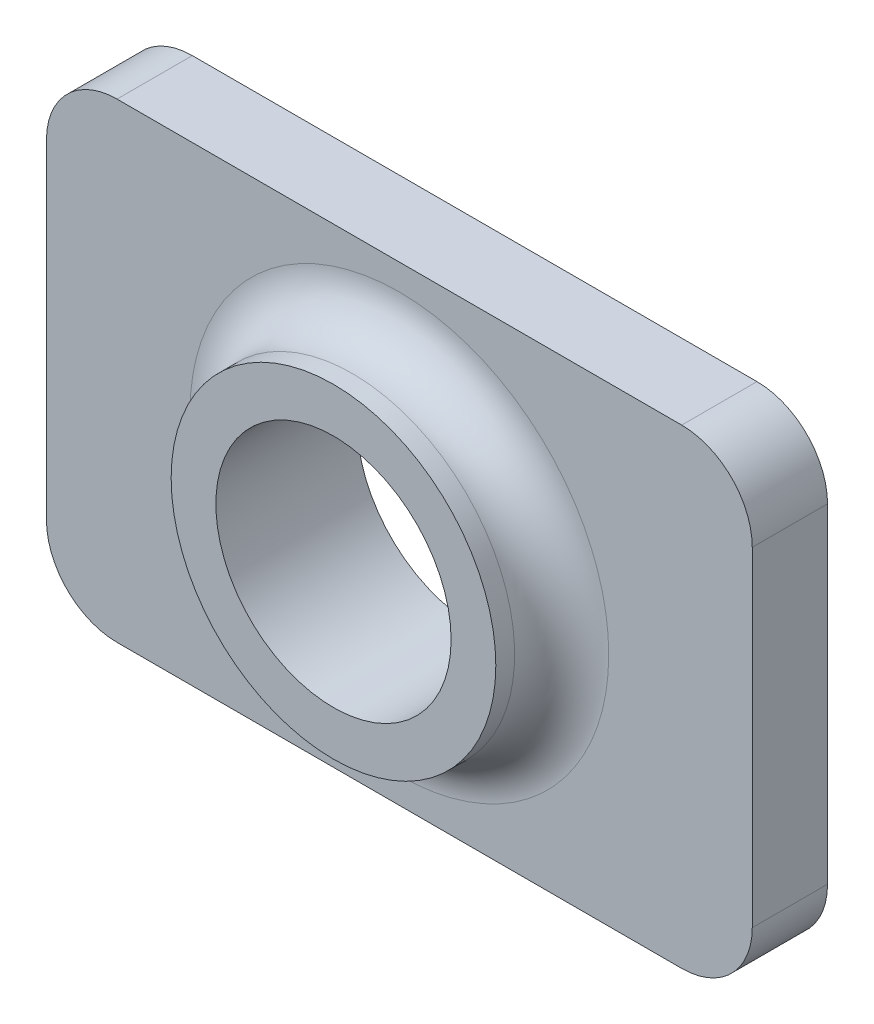
ISO-10303-21;
HEADER;
FILE_DESCRIPTION(('STEP AP214'),'2;1');
FILE_NAME('part.step','',(''),(''),'','','');
FILE_SCHEMA(('AUTOMOTIVE_DESIGN { 1 0 10303 214 1 1 1 1 }'));
ENDSEC;
DATA;
#1=APPLICATION_CONTEXT('core data for automotive mechanical design processes');
#2=APPLICATION_PROTOCOL_DEFINITION('international standard','automotive_design',2000,#1);
#3=PRODUCT_CONTEXT('',#1,'mechanical');
#4=PRODUCT('Part','Part','',(#3));
#5=PRODUCT_RELATED_PRODUCT_CATEGORY('part','',(#4));
#6=PRODUCT_DEFINITION_FORMATION('','',#4);
#7=PRODUCT_DEFINITION_CONTEXT('part definition',#1,'design');
#8=PRODUCT_DEFINITION('design','',#6,#7);
#9=PRODUCT_DEFINITION_SHAPE('','',#8);
#10=(LENGTH_UNIT() NAMED_UNIT(*) SI_UNIT(.MILLI.,.METRE.));
#11=(NAMED_UNIT(*) PLANE_ANGLE_UNIT() SI_UNIT($,.RADIAN.));
#12=(NAMED_UNIT(*) SI_UNIT($,.STERADIAN.) SOLID_ANGLE_UNIT());
#13=UNCERTAINTY_MEASURE_WITH_UNIT(LENGTH_MEASURE(1.E-05),#10,'distance_accuracy_value','');
#14=(GEOMETRIC_REPRESENTATION_CONTEXT(3) GLOBAL_UNCERTAINTY_ASSIGNED_CONTEXT((#13)) GLOBAL_UNIT_ASSIGNED_CONTEXT((#10,
#11,#12)) REPRESENTATION_CONTEXT('',''));
#15=CARTESIAN_POINT('',(0.,0.,0.));
#16=DIRECTION('',(0.,0.,1.));
#17=DIRECTION('',(1.,0.,0.));
#18=AXIS2_PLACEMENT_3D('',#15,#16,#17);
#19=CARTESIAN_POINT('',(0.,0.,1.6));
#20=DIRECTION('',(1.,0.,0.));
#21=DIRECTION('',(0.,0.,-1.));
#22=AXIS2_PLACEMENT_3D('',#19,#20,#21);
#23=PLANE('',#22);
#24=DIRECTION('',(0.,-1.,0.));
#25=VECTOR('',#24,1.);
#26=CARTESIAN_POINT('',(0.,0.,0.));
#27=LINE('',#26,#25);
#28=CARTESIAN_POINT('',(0.,8.5,0.));
#29=VERTEX_POINT('',#28);
#30=CARTESIAN_POINT('',(0.,1.5,0.));
#31=VERTEX_POINT('',#30);
#32=EDGE_CURVE('E130',#29,#31,#27,.T.);
#33=ORIENTED_EDGE('',*,*,#32,.T.);
#34=DIRECTION('',(0.,0.,-1.));
#35=VECTOR('',#34,1.);
#36=CARTESIAN_POINT('',(0.,1.5,1.6));
#37=LINE('',#36,#35);
#38=CARTESIAN_POINT('',(0.,1.5,1.6));
#39=VERTEX_POINT('',#38);
#40=EDGE_CURVE('E153',#31,#39,#37,.F.);
#41=ORIENTED_EDGE('',*,*,#40,.T.);
#42=DIRECTION('',(0.,-1.,0.));
#43=VECTOR('',#42,1.);
#44=CARTESIAN_POINT('',(0.,0.,1.6));
#45=LINE('',#44,#43);
#46=CARTESIAN_POINT('',(0.,8.5,1.6));
#47=VERTEX_POINT('',#46);
#48=EDGE_CURVE('E128',#47,#39,#45,.T.);
#49=ORIENTED_EDGE('',*,*,#48,.F.);
#50=DIRECTION('',(0.,0.,-1.));
#51=VECTOR('',#50,1.);
#52=CARTESIAN_POINT('',(0.,8.5,1.6));
#53=LINE('',#52,#51);
#54=EDGE_CURVE('E150',#47,#29,#53,.T.);
#55=ORIENTED_EDGE('',*,*,#54,.T.);
#56=EDGE_LOOP('',(#33,#41,#49,#55));
#57=FACE_BOUND('',#56,.T.);
#58=ADVANCED_FACE('F33',(#57),#23,.F.);
#59=CARTESIAN_POINT('',(0.,0.,1.6));
#60=DIRECTION('',(0.,1.,0.));
#61=DIRECTION('',(0.,0.,1.));
#62=AXIS2_PLACEMENT_3D('',#59,#60,#61);
#63=PLANE('',#62);
#64=DIRECTION('',(1.,0.,0.));
#65=VECTOR('',#64,1.);
#66=CARTESIAN_POINT('',(0.,0.,0.));
#67=LINE('',#66,#65);
#68=CARTESIAN_POINT('',(1.5,0.,0.));
#69=VERTEX_POINT('',#68);
#70=CARTESIAN_POINT('',(13.5,0.,0.));
#71=VERTEX_POINT('',#70);
#72=EDGE_CURVE('E126',#69,#71,#67,.T.);
#73=ORIENTED_EDGE('',*,*,#72,.T.);
#74=DIRECTION('',(0.,0.,-1.));
#75=VECTOR('',#74,1.);
#76=CARTESIAN_POINT('',(13.5,0.,1.6));
#77=LINE('',#76,#75);
#78=CARTESIAN_POINT('',(13.5,0.,1.6));
#79=VERTEX_POINT('',#78);
#80=EDGE_CURVE('E105',#71,#79,#77,.F.);
#81=ORIENTED_EDGE('',*,*,#80,.T.);
#82=DIRECTION('',(1.,0.,0.));
#83=VECTOR('',#82,1.);
#84=CARTESIAN_POINT('',(0.,0.,1.6));
#85=LINE('',#84,#83);
#86=CARTESIAN_POINT('',(1.5,0.,1.6));
#87=VERTEX_POINT('',#86);
#88=EDGE_CURVE('E211',#87,#79,#85,.T.);
#89=ORIENTED_EDGE('',*,*,#88,.F.);
#90=DIRECTION('',(0.,0.,-1.));
#91=VECTOR('',#90,1.);
#92=CARTESIAN_POINT('',(1.5,0.,1.6));
#93=LINE('',#92,#91);
#94=EDGE_CURVE('E110',#87,#69,#93,.T.);
#95=ORIENTED_EDGE('',*,*,#94,.T.);
#96=EDGE_LOOP('',(#73,#81,#89,#95));
#97=FACE_BOUND('',#96,.T.);
#98=ADVANCED_FACE('F175',(#97),#63,.F.);
#99=CARTESIAN_POINT('',(15.,0.,1.6));
#100=DIRECTION('',(-1.,0.,0.));
#101=DIRECTION('',(0.,0.,1.));
#102=AXIS2_PLACEMENT_3D('',#99,#100,#101);
#103=PLANE('',#102);
#104=DIRECTION('',(0.,1.,0.));
#105=VECTOR('',#104,1.);
#106=CARTESIAN_POINT('',(15.,0.,1.6));
#107=LINE('',#106,#105);
#108=CARTESIAN_POINT('',(15.,1.5,1.6));
#109=VERTEX_POINT('',#108);
#110=CARTESIAN_POINT('',(15.,8.5,1.6));
#111=VERTEX_POINT('',#110);
#112=EDGE_CURVE('E119',#109,#111,#107,.T.);
#113=ORIENTED_EDGE('',*,*,#112,.F.);
#114=DIRECTION('',(0.,0.,-1.));
#115=VECTOR('',#114,1.);
#116=CARTESIAN_POINT('',(15.,1.5,1.6));
#117=LINE('',#116,#115);
#118=CARTESIAN_POINT('',(15.,1.5,0.));
#119=VERTEX_POINT('',#118);
#120=EDGE_CURVE('E104',#109,#119,#117,.T.);
#121=ORIENTED_EDGE('',*,*,#120,.T.);
#122=DIRECTION('',(0.,1.,0.));
#123=VECTOR('',#122,1.);
#124=CARTESIAN_POINT('',(15.,0.,0.));
#125=LINE('',#124,#123);
#126=CARTESIAN_POINT('',(15.,8.5,0.));
#127=VERTEX_POINT('',#126);
#128=EDGE_CURVE('E117',#119,#127,#125,.T.);
#129=ORIENTED_EDGE('',*,*,#128,.T.);
#130=DIRECTION('',(0.,0.,-1.));
#131=VECTOR('',#130,1.);
#132=CARTESIAN_POINT('',(15.,8.5,1.6));
#133=LINE('',#132,#131);
#134=EDGE_CURVE('E121',#127,#111,#133,.F.);
#135=ORIENTED_EDGE('',*,*,#134,.T.);
#136=EDGE_LOOP('',(#113,#121,#129,#135));
#137=FACE_BOUND('',#136,.T.);
#138=ADVANCED_FACE('F116',(#137),#103,.F.);
#139=CARTESIAN_POINT('',(0.,10.,1.6));
#140=DIRECTION('',(0.,-1.,0.));
#141=DIRECTION('',(0.,0.,-1.));
#142=AXIS2_PLACEMENT_3D('',#139,#140,#141);
#143=PLANE('',#142);
#144=DIRECTION('',(-1.,0.,0.));
#145=VECTOR('',#144,1.);
#146=CARTESIAN_POINT('',(0.,10.,0.));
#147=LINE('',#146,#145);
#148=CARTESIAN_POINT('',(13.5,10.,0.));
#149=VERTEX_POINT('',#148);
#150=CARTESIAN_POINT('',(1.5,10.,0.));
#151=VERTEX_POINT('',#150);
#152=EDGE_CURVE('E125',#149,#151,#147,.T.);
#153=ORIENTED_EDGE('',*,*,#152,.T.);
#154=DIRECTION('',(0.,0.,-1.));
#155=VECTOR('',#154,1.);
#156=CARTESIAN_POINT('',(1.5,10.,1.6));
#157=LINE('',#156,#155);
#158=CARTESIAN_POINT('',(1.5,10.,1.6));
#159=VERTEX_POINT('',#158);
#160=EDGE_CURVE('E48',#151,#159,#157,.F.);
#161=ORIENTED_EDGE('',*,*,#160,.T.);
#162=DIRECTION('',(-1.,0.,0.));
#163=VECTOR('',#162,1.);
#164=CARTESIAN_POINT('',(0.,10.,1.6));
#165=LINE('',#164,#163);
#166=CARTESIAN_POINT('',(13.5,10.,1.6));
#167=VERTEX_POINT('',#166);
#168=EDGE_CURVE('E134',#167,#159,#165,.T.);
#169=ORIENTED_EDGE('',*,*,#168,.F.);
#170=DIRECTION('',(0.,0.,-1.));
#171=VECTOR('',#170,1.);
#172=CARTESIAN_POINT('',(13.5,10.,1.6));
#173=LINE('',#172,#171);
#174=EDGE_CURVE('E155',#167,#149,#173,.T.);
#175=ORIENTED_EDGE('',*,*,#174,.T.);
#176=EDGE_LOOP('',(#153,#161,#169,#175));
#177=FACE_BOUND('',#176,.T.);
#178=ADVANCED_FACE('F203',(#177),#143,.F.);
#179=CARTESIAN_POINT('',(0.,0.,1.6));
#180=DIRECTION('',(0.,0.,-1.));
#181=DIRECTION('',(-1.,0.,0.));
#182=AXIS2_PLACEMENT_3D('',#179,#180,#181);
#183=PLANE('',#182);
#184=CARTESIAN_POINT('',(7.5,5.,1.6));
#185=DIRECTION('',(0.,0.,-1.));
#186=DIRECTION('',(-1.,0.,0.));
#187=AXIS2_PLACEMENT_3D('',#184,#185,#186);
#188=CIRCLE('',#187,4.45);
#189=CARTESIAN_POINT('',(3.05,5.,1.6));
#190=VERTEX_POINT('',#189);
#191=EDGE_CURVE('E11',#190,#190,#188,.T.);
#192=ORIENTED_EDGE('',*,*,#191,.T.);
#193=EDGE_LOOP('',(#192));
#194=FACE_BOUND('',#193,.T.);
#195=ORIENTED_EDGE('',*,*,#88,.T.);
#196=CARTESIAN_POINT('',(13.5,1.5,1.6));
#197=DIRECTION('',(0.,0.,-1.));
#198=DIRECTION('',(-1.,0.,0.));
#199=AXIS2_PLACEMENT_3D('',#196,#197,#198);
#200=CIRCLE('',#199,1.5);
#201=EDGE_CURVE('E148',#79,#109,#200,.F.);
#202=ORIENTED_EDGE('',*,*,#201,.T.);
#203=ORIENTED_EDGE('',*,*,#112,.T.);
#204=CARTESIAN_POINT('',(13.5,8.5,1.6));
#205=DIRECTION('',(0.,0.,-1.));
#206=DIRECTION('',(-1.,0.,0.));
#207=AXIS2_PLACEMENT_3D('',#204,#205,#206);
#208=CIRCLE('',#207,1.5);
#209=EDGE_CURVE('E55',#111,#167,#208,.F.);
#210=ORIENTED_EDGE('',*,*,#209,.T.);
#211=ORIENTED_EDGE('',*,*,#168,.T.);
#212=CARTESIAN_POINT('',(1.5,8.5,1.6));
#213=DIRECTION('',(0.,0.,-1.));
#214=DIRECTION('',(-1.,0.,0.));
#215=AXIS2_PLACEMENT_3D('',#212,#213,#214);
#216=CIRCLE('',#215,1.5);
#217=EDGE_CURVE('E144',#159,#47,#216,.F.);
#218=ORIENTED_EDGE('',*,*,#217,.T.);
#219=ORIENTED_EDGE('',*,*,#48,.T.);
#220=CARTESIAN_POINT('',(1.5,1.5,1.6));
#221=DIRECTION('',(0.,0.,-1.));
#222=DIRECTION('',(-1.,0.,0.));
#223=AXIS2_PLACEMENT_3D('',#220,#221,#222);
#224=CIRCLE('',#223,1.5);
#225=EDGE_CURVE('E146',#39,#87,#224,.F.);
#226=ORIENTED_EDGE('',*,*,#225,.T.);
#227=EDGE_LOOP('',(#195,#202,#203,#210,#211,#218,#219,#226));
#228=FACE_BOUND('',#227,.T.);
#229=ADVANCED_FACE('F233',(#194,#228),#183,.F.);
#230=CARTESIAN_POINT('',(0.,0.,0.));
#231=DIRECTION('',(0.,0.,-1.));
#232=DIRECTION('',(-1.,0.,0.));
#233=AXIS2_PLACEMENT_3D('',#230,#231,#232);
#234=PLANE('',#233);
#235=CARTESIAN_POINT('',(7.5,5.,0.));
#236=DIRECTION('',(0.,0.,1.));
#237=DIRECTION('',(1.,0.,0.));
#238=AXIS2_PLACEMENT_3D('',#235,#236,#237);
#239=CIRCLE('',#238,2.5);
#240=CARTESIAN_POINT('',(10.,5.,0.));
#241=VERTEX_POINT('',#240);
#242=EDGE_CURVE('E225',#241,#241,#239,.T.);
#243=ORIENTED_EDGE('',*,*,#242,.T.);
#244=EDGE_LOOP('',(#243));
#245=FACE_BOUND('',#244,.T.);
#246=ORIENTED_EDGE('',*,*,#128,.F.);
#247=CARTESIAN_POINT('',(13.5,1.5,0.));
#248=DIRECTION('',(0.,0.,-1.));
#249=DIRECTION('',(-1.,0.,0.));
#250=AXIS2_PLACEMENT_3D('',#247,#248,#249);
#251=CIRCLE('',#250,1.5);
#252=EDGE_CURVE('E100',#119,#71,#251,.T.);
#253=ORIENTED_EDGE('',*,*,#252,.T.);
#254=ORIENTED_EDGE('',*,*,#72,.F.);
#255=CARTESIAN_POINT('',(1.5,1.5,0.));
#256=DIRECTION('',(0.,0.,-1.));
#257=DIRECTION('',(-1.,0.,0.));
#258=AXIS2_PLACEMENT_3D('',#255,#256,#257);
#259=CIRCLE('',#258,1.5);
#260=EDGE_CURVE('E111',#69,#31,#259,.T.);
#261=ORIENTED_EDGE('',*,*,#260,.T.);
#262=ORIENTED_EDGE('',*,*,#32,.F.);
#263=CARTESIAN_POINT('',(1.5,8.5,0.));
#264=DIRECTION('',(0.,0.,-1.));
#265=DIRECTION('',(-1.,0.,0.));
#266=AXIS2_PLACEMENT_3D('',#263,#264,#265);
#267=CIRCLE('',#266,1.5);
#268=EDGE_CURVE('E137',#29,#151,#267,.T.);
#269=ORIENTED_EDGE('',*,*,#268,.T.);
#270=ORIENTED_EDGE('',*,*,#152,.F.);
#271=CARTESIAN_POINT('',(13.5,8.5,0.));
#272=DIRECTION('',(0.,0.,-1.));
#273=DIRECTION('',(-1.,0.,0.));
#274=AXIS2_PLACEMENT_3D('',#271,#272,#273);
#275=CIRCLE('',#274,1.5);
#276=EDGE_CURVE('E120',#149,#127,#275,.T.);
#277=ORIENTED_EDGE('',*,*,#276,.T.);
#278=EDGE_LOOP('',(#246,#253,#254,#261,#262,#269,#270,#277));
#279=FACE_BOUND('',#278,.T.);
#280=ADVANCED_FACE('F123',(#245,#279),#234,.T.);
#281=CARTESIAN_POINT('',(13.5,1.5,1.6));
#282=DIRECTION('',(0.,0.,-1.));
#283=DIRECTION('',(-1.,0.,0.));
#284=AXIS2_PLACEMENT_3D('',#281,#282,#283);
#285=CYLINDRICAL_SURFACE('',#284,1.5);
#286=ORIENTED_EDGE('',*,*,#201,.F.);
#287=ORIENTED_EDGE('',*,*,#80,.F.);
#288=ORIENTED_EDGE('',*,*,#252,.F.);
#289=ORIENTED_EDGE('',*,*,#120,.F.);
#290=EDGE_LOOP('',(#286,#287,#288,#289));
#291=FACE_BOUND('',#290,.T.);
#292=ADVANCED_FACE('F103',(#291),#285,.T.);
#293=CARTESIAN_POINT('',(1.5,1.5,1.6));
#294=DIRECTION('',(0.,0.,-1.));
#295=DIRECTION('',(-1.,0.,0.));
#296=AXIS2_PLACEMENT_3D('',#293,#294,#295);
#297=CYLINDRICAL_SURFACE('',#296,1.5);
#298=ORIENTED_EDGE('',*,*,#225,.F.);
#299=ORIENTED_EDGE('',*,*,#40,.F.);
#300=ORIENTED_EDGE('',*,*,#260,.F.);
#301=ORIENTED_EDGE('',*,*,#94,.F.);
#302=EDGE_LOOP('',(#298,#299,#300,#301));
#303=FACE_BOUND('',#302,.T.);
#304=ADVANCED_FACE('F188',(#303),#297,.T.);
#305=CARTESIAN_POINT('',(1.5,8.5,1.6));
#306=DIRECTION('',(0.,0.,-1.));
#307=DIRECTION('',(-1.,0.,0.));
#308=AXIS2_PLACEMENT_3D('',#305,#306,#307);
#309=CYLINDRICAL_SURFACE('',#308,1.5);
#310=ORIENTED_EDGE('',*,*,#217,.F.);
#311=ORIENTED_EDGE('',*,*,#160,.F.);
#312=ORIENTED_EDGE('',*,*,#268,.F.);
#313=ORIENTED_EDGE('',*,*,#54,.F.);
#314=EDGE_LOOP('',(#310,#311,#312,#313));
#315=FACE_BOUND('',#314,.T.);
#316=ADVANCED_FACE('F191',(#315),#309,.T.);
#317=CARTESIAN_POINT('',(13.5,8.5,1.6));
#318=DIRECTION('',(0.,0.,-1.));
#319=DIRECTION('',(-1.,0.,0.));
#320=AXIS2_PLACEMENT_3D('',#317,#318,#319);
#321=CYLINDRICAL_SURFACE('',#320,1.5);
#322=ORIENTED_EDGE('',*,*,#209,.F.);
#323=ORIENTED_EDGE('',*,*,#134,.F.);
#324=ORIENTED_EDGE('',*,*,#276,.F.);
#325=ORIENTED_EDGE('',*,*,#174,.F.);
#326=EDGE_LOOP('',(#322,#323,#324,#325));
#327=FACE_BOUND('',#326,.T.);
#328=ADVANCED_FACE('F194',(#327),#321,.T.);
#329=CARTESIAN_POINT('',(7.5,5.,3.));
#330=DIRECTION('',(0.,0.,-1.));
#331=DIRECTION('',(-1.,0.,0.));
#332=AXIS2_PLACEMENT_3D('',#329,#330,#331);
#333=CYLINDRICAL_SURFACE('',#332,3.45);
#334=CARTESIAN_POINT('',(7.5,5.,2.6));
#335=DIRECTION('',(0.,0.,-1.));
#336=DIRECTION('',(-1.,0.,0.));
#337=AXIS2_PLACEMENT_3D('',#334,#335,#336);
#338=CIRCLE('',#337,3.45);
#339=CARTESIAN_POINT('',(4.05,5.,2.6));
#340=VERTEX_POINT('',#339);
#341=EDGE_CURVE('E41',#340,#340,#338,.F.);
#342=ORIENTED_EDGE('',*,*,#341,.T.);
#343=EDGE_LOOP('',(#342));
#344=FACE_BOUND('',#343,.T.);
#345=CARTESIAN_POINT('',(7.5,5.,3.));
#346=DIRECTION('',(0.,0.,1.));
#347=DIRECTION('',(1.,0.,0.));
#348=AXIS2_PLACEMENT_3D('',#345,#346,#347);
#349=CIRCLE('',#348,3.45);
#350=CARTESIAN_POINT('',(10.95,5.,3.));
#351=VERTEX_POINT('',#350);
#352=EDGE_CURVE('E216',#351,#351,#349,.T.);
#353=ORIENTED_EDGE('',*,*,#352,.F.);
#354=EDGE_LOOP('',(#353));
#355=FACE_BOUND('',#354,.T.);
#356=ADVANCED_FACE('F161',(#344,#355),#333,.T.);
#357=CARTESIAN_POINT('',(7.5,5.,3.));
#358=DIRECTION('',(0.,0.,1.));
#359=DIRECTION('',(1.,0.,0.));
#360=AXIS2_PLACEMENT_3D('',#357,#358,#359);
#361=PLANE('',#360);
#362=CARTESIAN_POINT('',(7.5,5.,3.));
#363=DIRECTION('',(0.,0.,1.));
#364=DIRECTION('',(1.,0.,0.));
#365=AXIS2_PLACEMENT_3D('',#362,#363,#364);
#366=CIRCLE('',#365,2.5);
#367=CARTESIAN_POINT('',(10.,5.,3.));
#368=VERTEX_POINT('',#367);
#369=EDGE_CURVE('E221',#368,#368,#366,.T.);
#370=ORIENTED_EDGE('',*,*,#369,.F.);
#371=EDGE_LOOP('',(#370));
#372=FACE_BOUND('',#371,.T.);
#373=ORIENTED_EDGE('',*,*,#352,.T.);
#374=EDGE_LOOP('',(#373));
#375=FACE_BOUND('',#374,.T.);
#376=ADVANCED_FACE('F170',(#372,#375),#361,.T.);
#377=CARTESIAN_POINT('',(7.5,5.,3.));
#378=DIRECTION('',(0.,0.,-1.));
#379=DIRECTION('',(-1.,0.,0.));
#380=AXIS2_PLACEMENT_3D('',#377,#378,#379);
#381=CYLINDRICAL_SURFACE('',#380,2.5);
#382=ORIENTED_EDGE('',*,*,#369,.T.);
#383=EDGE_LOOP('',(#382));
#384=FACE_BOUND('',#383,.T.);
#385=ORIENTED_EDGE('',*,*,#242,.F.);
#386=EDGE_LOOP('',(#385));
#387=FACE_BOUND('',#386,.T.);
#388=ADVANCED_FACE('F165',(#384,#387),#381,.F.);
#389=CARTESIAN_POINT('',(7.5,5.,2.6));
#390=DIRECTION('',(0.,0.,-1.));
#391=DIRECTION('',(-1.,0.,0.));
#392=AXIS2_PLACEMENT_3D('',#389,#390,#391);
#393=TOROIDAL_SURFACE('',#392,4.45,1.);
#394=ORIENTED_EDGE('',*,*,#191,.F.);
#395=EDGE_LOOP('',(#394));
#396=FACE_BOUND('',#395,.T.);
#397=ORIENTED_EDGE('',*,*,#341,.F.);
#398=EDGE_LOOP('',(#397));
#399=FACE_BOUND('',#398,.T.);
#400=ADVANCED_FACE('F35',(#396,#399),#393,.F.);
#401=CLOSED_SHELL('',(#58,#98,#138,#178,#229,#280,#292,#304,#316,#328,#356,#376,#388,#400));
#402=MANIFOLD_SOLID_BREP('B2',#401);
#403=ADVANCED_BREP_SHAPE_REPRESENTATION('',(#18,#402),#14);
#404=SHAPE_DEFINITION_REPRESENTATION(#9,#403);
ENDSEC;
END-ISO-10303-21;
